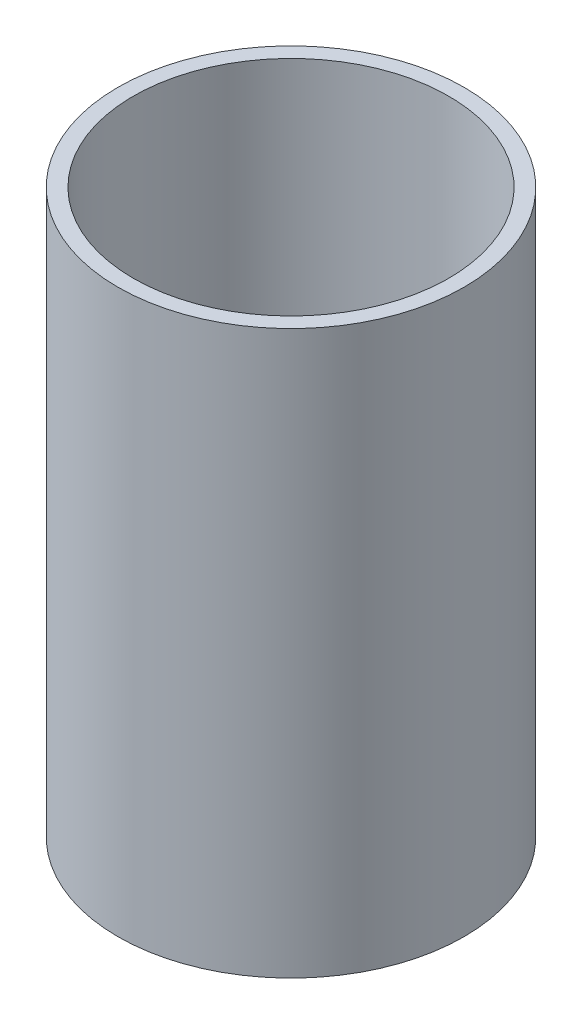
ISO-10303-21;
HEADER;
FILE_DESCRIPTION(('STEP AP214'),'2;1');
FILE_NAME('part.step','',(''),(''),'','','');
FILE_SCHEMA(('AUTOMOTIVE_DESIGN { 1 0 10303 214 1 1 1 1 }'));
ENDSEC;
DATA;
#1=APPLICATION_CONTEXT('core data for automotive mechanical design processes');
#2=APPLICATION_PROTOCOL_DEFINITION('international standard','automotive_design',2000,#1);
#3=PRODUCT_CONTEXT('',#1,'mechanical');
#4=PRODUCT('Part','Part','',(#3));
#5=PRODUCT_RELATED_PRODUCT_CATEGORY('part','',(#4));
#6=PRODUCT_DEFINITION_FORMATION('','',#4);
#7=PRODUCT_DEFINITION_CONTEXT('part definition',#1,'design');
#8=PRODUCT_DEFINITION('design','',#6,#7);
#9=PRODUCT_DEFINITION_SHAPE('','',#8);
#10=(LENGTH_UNIT() NAMED_UNIT(*) SI_UNIT(.MILLI.,.METRE.));
#11=(NAMED_UNIT(*) PLANE_ANGLE_UNIT() SI_UNIT($,.RADIAN.));
#12=(NAMED_UNIT(*) SI_UNIT($,.STERADIAN.) SOLID_ANGLE_UNIT());
#13=UNCERTAINTY_MEASURE_WITH_UNIT(LENGTH_MEASURE(1.E-05),#10,'distance_accuracy_value','');
#14=(GEOMETRIC_REPRESENTATION_CONTEXT(3) GLOBAL_UNCERTAINTY_ASSIGNED_CONTEXT((#13)) GLOBAL_UNIT_ASSIGNED_CONTEXT((#10,
#11,#12)) REPRESENTATION_CONTEXT('',''));
#15=CARTESIAN_POINT('',(0.,0.,0.));
#16=DIRECTION('',(0.,0.,1.));
#17=DIRECTION('',(1.,0.,0.));
#18=AXIS2_PLACEMENT_3D('',#15,#16,#17);
#19=CARTESIAN_POINT('',(0.,170.593436560366,0.));
#20=DIRECTION('',(0.,-1.,0.));
#21=DIRECTION('',(0.,0.,-1.));
#22=AXIS2_PLACEMENT_3D('',#19,#20,#21);
#23=CYLINDRICAL_SURFACE('',#22,52.5);
#24=CARTESIAN_POINT('',(0.,170.593436560366,0.));
#25=DIRECTION('',(0.,1.,0.));
#26=DIRECTION('',(0.,0.,1.));
#27=AXIS2_PLACEMENT_3D('',#24,#25,#26);
#28=CIRCLE('',#27,52.5);
#29=CARTESIAN_POINT('',(0.,170.593436560366,52.5));
#30=VERTEX_POINT('',#29);
#31=EDGE_CURVE('E10',#30,#30,#28,.T.);
#32=ORIENTED_EDGE('',*,*,#31,.F.);
#33=EDGE_LOOP('',(#32));
#34=FACE_BOUND('',#33,.T.);
#35=CARTESIAN_POINT('',(0.,0.,0.));
#36=DIRECTION('',(0.,1.,0.));
#37=DIRECTION('',(0.,0.,1.));
#38=AXIS2_PLACEMENT_3D('',#35,#36,#37);
#39=CIRCLE('',#38,52.5);
#40=CARTESIAN_POINT('',(0.,0.,52.5));
#41=VERTEX_POINT('',#40);
#42=EDGE_CURVE('E37',#41,#41,#39,.T.);
#43=ORIENTED_EDGE('',*,*,#42,.T.);
#44=EDGE_LOOP('',(#43));
#45=FACE_BOUND('',#44,.T.);
#46=ADVANCED_FACE('F40',(#34,#45),#23,.T.);
#47=CARTESIAN_POINT('',(0.,170.593436560366,0.));
#48=DIRECTION('',(0.,1.,0.));
#49=DIRECTION('',(0.,0.,1.));
#50=AXIS2_PLACEMENT_3D('',#47,#48,#49);
#51=PLANE('',#50);
#52=CARTESIAN_POINT('',(0.,170.593436560366,0.));
#53=DIRECTION('',(0.,1.,0.));
#54=DIRECTION('',(0.,0.,1.));
#55=AXIS2_PLACEMENT_3D('',#52,#53,#54);
#56=CIRCLE('',#55,47.838914209473);
#57=CARTESIAN_POINT('',(0.,170.593436560366,47.838914209473));
#58=VERTEX_POINT('',#57);
#59=EDGE_CURVE('E50',#58,#58,#56,.T.);
#60=ORIENTED_EDGE('',*,*,#59,.F.);
#61=EDGE_LOOP('',(#60));
#62=FACE_BOUND('',#61,.T.);
#63=ORIENTED_EDGE('',*,*,#31,.T.);
#64=EDGE_LOOP('',(#63));
#65=FACE_BOUND('',#64,.T.);
#66=ADVANCED_FACE('F59',(#62,#65),#51,.T.);
#67=CARTESIAN_POINT('',(0.,0.,0.));
#68=DIRECTION('',(0.,1.,0.));
#69=DIRECTION('',(0.,0.,1.));
#70=AXIS2_PLACEMENT_3D('',#67,#68,#69);
#71=PLANE('',#70);
#72=CARTESIAN_POINT('',(0.,0.,0.));
#73=DIRECTION('',(0.,1.,0.));
#74=DIRECTION('',(0.,0.,1.));
#75=AXIS2_PLACEMENT_3D('',#72,#73,#74);
#76=CIRCLE('',#75,47.838914209473);
#77=CARTESIAN_POINT('',(0.,0.,47.838914209473));
#78=VERTEX_POINT('',#77);
#79=EDGE_CURVE('E47',#78,#78,#76,.T.);
#80=ORIENTED_EDGE('',*,*,#79,.T.);
#81=EDGE_LOOP('',(#80));
#82=FACE_BOUND('',#81,.T.);
#83=ORIENTED_EDGE('',*,*,#42,.F.);
#84=EDGE_LOOP('',(#83));
#85=FACE_BOUND('',#84,.T.);
#86=ADVANCED_FACE('F58',(#82,#85),#71,.F.);
#87=CARTESIAN_POINT('',(0.,170.593436560366,0.));
#88=DIRECTION('',(0.,-1.,0.));
#89=DIRECTION('',(0.,0.,-1.));
#90=AXIS2_PLACEMENT_3D('',#87,#88,#89);
#91=CYLINDRICAL_SURFACE('',#90,47.838914209473);
#92=ORIENTED_EDGE('',*,*,#59,.T.);
#93=EDGE_LOOP('',(#92));
#94=FACE_BOUND('',#93,.T.);
#95=ORIENTED_EDGE('',*,*,#79,.F.);
#96=EDGE_LOOP('',(#95));
#97=FACE_BOUND('',#96,.T.);
#98=ADVANCED_FACE('F54',(#94,#97),#91,.F.);
#99=CLOSED_SHELL('',(#46,#66,#86,#98));
#100=MANIFOLD_SOLID_BREP('B2',#99);
#101=ADVANCED_BREP_SHAPE_REPRESENTATION('',(#18,#100),#14);
#102=SHAPE_DEFINITION_REPRESENTATION(#9,#101);
ENDSEC;
END-ISO-10303-21;
